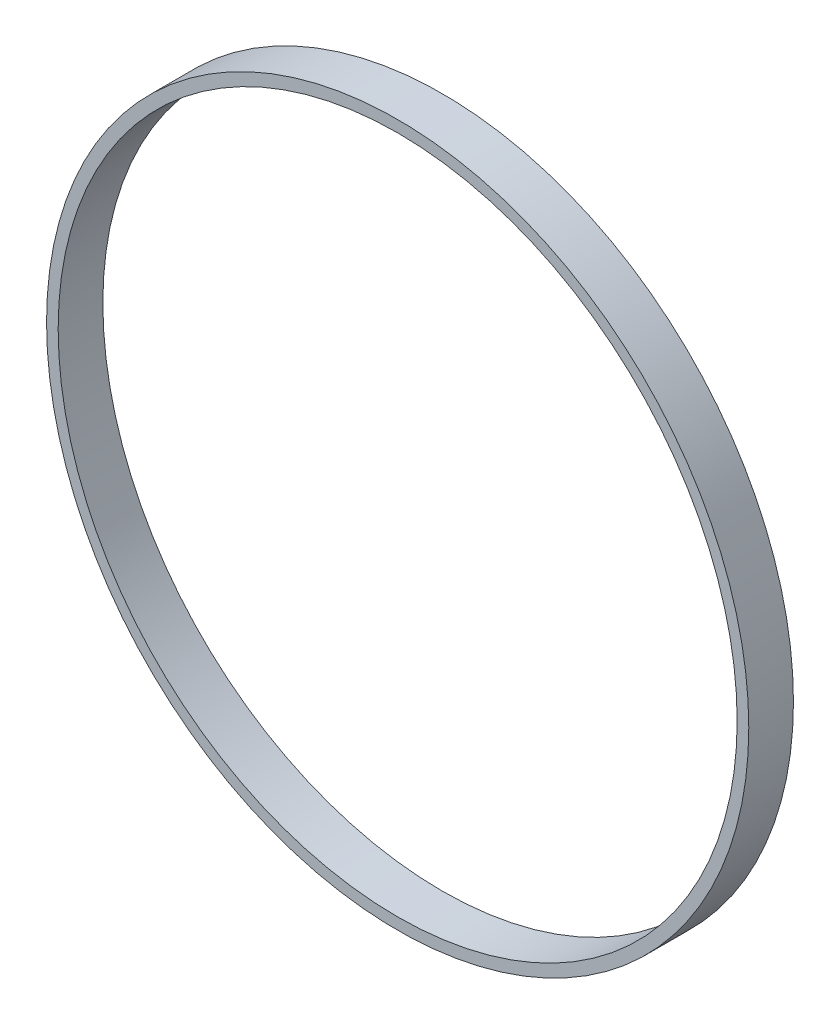
ISO-10303-21;
HEADER;
FILE_DESCRIPTION(('STEP AP214'),'2;1');
FILE_NAME('part.step','',(''),(''),'','','');
FILE_SCHEMA(('AUTOMOTIVE_DESIGN { 1 0 10303 214 1 1 1 1 }'));
ENDSEC;
DATA;
#1=APPLICATION_CONTEXT('core data for automotive mechanical design processes');
#2=APPLICATION_PROTOCOL_DEFINITION('international standard','automotive_design',2000,#1);
#3=PRODUCT_CONTEXT('',#1,'mechanical');
#4=PRODUCT('Part','Part','',(#3));
#5=PRODUCT_RELATED_PRODUCT_CATEGORY('part','',(#4));
#6=PRODUCT_DEFINITION_FORMATION('','',#4);
#7=PRODUCT_DEFINITION_CONTEXT('part definition',#1,'design');
#8=PRODUCT_DEFINITION('design','',#6,#7);
#9=PRODUCT_DEFINITION_SHAPE('','',#8);
#10=(LENGTH_UNIT() NAMED_UNIT(*) SI_UNIT(.MILLI.,.METRE.));
#11=(NAMED_UNIT(*) PLANE_ANGLE_UNIT() SI_UNIT($,.RADIAN.));
#12=(NAMED_UNIT(*) SI_UNIT($,.STERADIAN.) SOLID_ANGLE_UNIT());
#13=UNCERTAINTY_MEASURE_WITH_UNIT(LENGTH_MEASURE(1.E-05),#10,'distance_accuracy_value','');
#14=(GEOMETRIC_REPRESENTATION_CONTEXT(3) GLOBAL_UNCERTAINTY_ASSIGNED_CONTEXT((#13)) GLOBAL_UNIT_ASSIGNED_CONTEXT((#10,
#11,#12)) REPRESENTATION_CONTEXT('',''));
#15=CARTESIAN_POINT('',(0.,0.,0.));
#16=DIRECTION('',(0.,0.,1.));
#17=DIRECTION('',(1.,0.,0.));
#18=AXIS2_PLACEMENT_3D('',#15,#16,#17);
#19=CARTESIAN_POINT('',(0.,0.,10.));
#20=DIRECTION('',(0.,0.,1.));
#21=DIRECTION('',(1.,0.,0.));
#22=AXIS2_PLACEMENT_3D('',#19,#20,#21);
#23=PLANE('',#22);
#24=CARTESIAN_POINT('',(0.,0.,10.));
#25=DIRECTION('',(0.,0.,1.));
#26=DIRECTION('',(1.,0.,0.));
#27=AXIS2_PLACEMENT_3D('',#24,#25,#26);
#28=CIRCLE('',#27,78.6);
#29=CARTESIAN_POINT('',(78.6,0.,10.));
#30=VERTEX_POINT('',#29);
#31=EDGE_CURVE('E10',#30,#30,#28,.T.);
#32=ORIENTED_EDGE('',*,*,#31,.T.);
#33=EDGE_LOOP('',(#32));
#34=FACE_BOUND('',#33,.T.);
#35=CARTESIAN_POINT('',(0.,0.,10.));
#36=DIRECTION('',(0.,0.,1.));
#37=DIRECTION('',(1.,0.,0.));
#38=AXIS2_PLACEMENT_3D('',#35,#36,#37);
#39=CIRCLE('',#38,76.);
#40=CARTESIAN_POINT('',(76.,0.,10.));
#41=VERTEX_POINT('',#40);
#42=EDGE_CURVE('E41',#41,#41,#39,.T.);
#43=ORIENTED_EDGE('',*,*,#42,.F.);
#44=EDGE_LOOP('',(#43));
#45=FACE_BOUND('',#44,.T.);
#46=ADVANCED_FACE('F30',(#34,#45),#23,.T.);
#47=CARTESIAN_POINT('',(0.,0.,0.));
#48=DIRECTION('',(0.,0.,1.));
#49=DIRECTION('',(1.,0.,0.));
#50=AXIS2_PLACEMENT_3D('',#47,#48,#49);
#51=PLANE('',#50);
#52=CARTESIAN_POINT('',(0.,0.,0.));
#53=DIRECTION('',(0.,0.,1.));
#54=DIRECTION('',(1.,0.,0.));
#55=AXIS2_PLACEMENT_3D('',#52,#53,#54);
#56=CIRCLE('',#55,78.6);
#57=CARTESIAN_POINT('',(78.6,0.,0.));
#58=VERTEX_POINT('',#57);
#59=EDGE_CURVE('E34',#58,#58,#56,.T.);
#60=ORIENTED_EDGE('',*,*,#59,.F.);
#61=EDGE_LOOP('',(#60));
#62=FACE_BOUND('',#61,.T.);
#63=CARTESIAN_POINT('',(0.,0.,0.));
#64=DIRECTION('',(0.,0.,1.));
#65=DIRECTION('',(1.,0.,0.));
#66=AXIS2_PLACEMENT_3D('',#63,#64,#65);
#67=CIRCLE('',#66,76.);
#68=CARTESIAN_POINT('',(76.,0.,0.));
#69=VERTEX_POINT('',#68);
#70=EDGE_CURVE('E43',#69,#69,#67,.T.);
#71=ORIENTED_EDGE('',*,*,#70,.T.);
#72=EDGE_LOOP('',(#71));
#73=FACE_BOUND('',#72,.T.);
#74=ADVANCED_FACE('F53',(#62,#73),#51,.F.);
#75=CARTESIAN_POINT('',(0.,0.,10.));
#76=DIRECTION('',(0.,0.,-1.));
#77=DIRECTION('',(-1.,0.,0.));
#78=AXIS2_PLACEMENT_3D('',#75,#76,#77);
#79=CYLINDRICAL_SURFACE('',#78,78.6);
#80=ORIENTED_EDGE('',*,*,#31,.F.);
#81=EDGE_LOOP('',(#80));
#82=FACE_BOUND('',#81,.T.);
#83=ORIENTED_EDGE('',*,*,#59,.T.);
#84=EDGE_LOOP('',(#83));
#85=FACE_BOUND('',#84,.T.);
#86=ADVANCED_FACE('F32',(#82,#85),#79,.T.);
#87=CARTESIAN_POINT('',(0.,0.,10.));
#88=DIRECTION('',(0.,0.,-1.));
#89=DIRECTION('',(-1.,0.,0.));
#90=AXIS2_PLACEMENT_3D('',#87,#88,#89);
#91=CYLINDRICAL_SURFACE('',#90,76.);
#92=ORIENTED_EDGE('',*,*,#42,.T.);
#93=EDGE_LOOP('',(#92));
#94=FACE_BOUND('',#93,.T.);
#95=ORIENTED_EDGE('',*,*,#70,.F.);
#96=EDGE_LOOP('',(#95));
#97=FACE_BOUND('',#96,.T.);
#98=ADVANCED_FACE('F49',(#94,#97),#91,.F.);
#99=CLOSED_SHELL('',(#46,#74,#86,#98));
#100=MANIFOLD_SOLID_BREP('B2',#99);
#101=ADVANCED_BREP_SHAPE_REPRESENTATION('',(#18,#100),#14);
#102=SHAPE_DEFINITION_REPRESENTATION(#9,#101);
ENDSEC;
END-ISO-10303-21;
